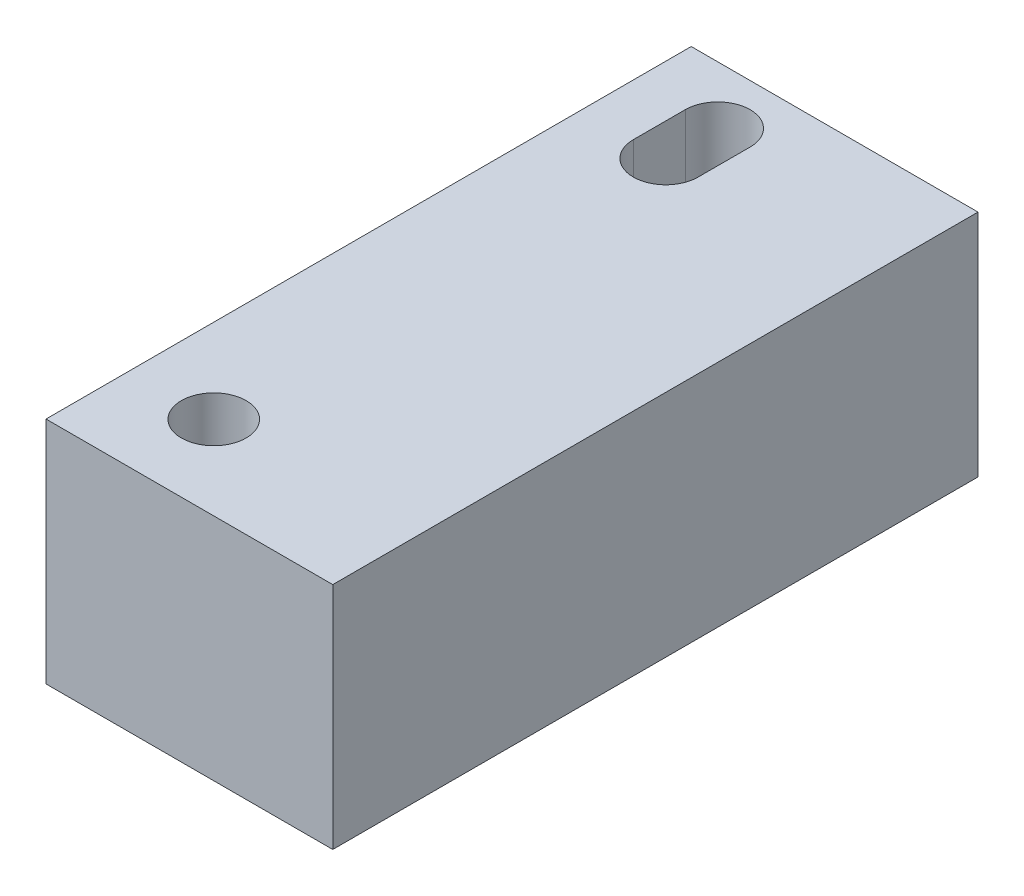
ISO-10303-21;
HEADER;
FILE_DESCRIPTION(('STEP AP214'),'2;1');
FILE_NAME('part.step','',(''),(''),'','','');
FILE_SCHEMA(('AUTOMOTIVE_DESIGN { 1 0 10303 214 1 1 1 1 }'));
ENDSEC;
DATA;
#1=APPLICATION_CONTEXT('core data for automotive mechanical design processes');
#2=APPLICATION_PROTOCOL_DEFINITION('international standard','automotive_design',2000,#1);
#3=PRODUCT_CONTEXT('',#1,'mechanical');
#4=PRODUCT('Part','Part','',(#3));
#5=PRODUCT_RELATED_PRODUCT_CATEGORY('part','',(#4));
#6=PRODUCT_DEFINITION_FORMATION('','',#4);
#7=PRODUCT_DEFINITION_CONTEXT('part definition',#1,'design');
#8=PRODUCT_DEFINITION('design','',#6,#7);
#9=PRODUCT_DEFINITION_SHAPE('','',#8);
#10=(LENGTH_UNIT() NAMED_UNIT(*) SI_UNIT(.MILLI.,.METRE.));
#11=(NAMED_UNIT(*) PLANE_ANGLE_UNIT() SI_UNIT($,.RADIAN.));
#12=(NAMED_UNIT(*) SI_UNIT($,.STERADIAN.) SOLID_ANGLE_UNIT());
#13=UNCERTAINTY_MEASURE_WITH_UNIT(LENGTH_MEASURE(1.E-05),#10,'distance_accuracy_value','');
#14=(GEOMETRIC_REPRESENTATION_CONTEXT(3) GLOBAL_UNCERTAINTY_ASSIGNED_CONTEXT((#13)) GLOBAL_UNIT_ASSIGNED_CONTEXT((#10,
#11,#12)) REPRESENTATION_CONTEXT('',''));
#15=CARTESIAN_POINT('',(0.,0.,0.));
#16=DIRECTION('',(0.,0.,1.));
#17=DIRECTION('',(1.,0.,0.));
#18=AXIS2_PLACEMENT_3D('',#15,#16,#17);
#19=CARTESIAN_POINT('',(-25.7385806955994,15.24,-19.8332435881479));
#20=DIRECTION('',(0.,-1.,0.));
#21=DIRECTION('',(0.,0.,-1.));
#22=AXIS2_PLACEMENT_3D('',#19,#20,#21);
#23=PLANE('',#22);
#24=DIRECTION('',(0.,0.,1.));
#25=VECTOR('',#24,1.);
#26=CARTESIAN_POINT('',(-22.3032306955994,15.24,-16.0041935881479));
#27=LINE('',#26,#25);
#28=CARTESIAN_POINT('',(-22.3032306955994,15.24,-16.0041935881479));
#29=VERTEX_POINT('',#28);
#30=CARTESIAN_POINT('',(-22.3032306955994,15.24,-12.5497935881479));
#31=VERTEX_POINT('',#30);
#32=EDGE_CURVE('E116',#29,#31,#27,.T.);
#33=ORIENTED_EDGE('',*,*,#32,.F.);
#34=CARTESIAN_POINT('',(-20.1505806955994,15.24,-16.0041935881479));
#35=DIRECTION('',(0.,1.,0.));
#36=DIRECTION('',(0.,0.,1.));
#37=AXIS2_PLACEMENT_3D('',#34,#35,#36);
#38=CIRCLE('',#37,2.15265);
#39=CARTESIAN_POINT('',(-17.9979306955994,15.24,-16.0041935881479));
#40=VERTEX_POINT('',#39);
#41=EDGE_CURVE('E47',#40,#29,#38,.T.);
#42=ORIENTED_EDGE('',*,*,#41,.F.);
#43=DIRECTION('',(0.,0.,-1.));
#44=VECTOR('',#43,1.);
#45=CARTESIAN_POINT('',(-17.9979306955994,15.24,-16.0041935881479));
#46=LINE('',#45,#44);
#47=CARTESIAN_POINT('',(-17.9979306955994,15.24,-12.5497935881479));
#48=VERTEX_POINT('',#47);
#49=EDGE_CURVE('E109',#48,#40,#46,.T.);
#50=ORIENTED_EDGE('',*,*,#49,.F.);
#51=CARTESIAN_POINT('',(-20.1505806955994,15.24,-12.5497935881479));
#52=DIRECTION('',(0.,1.,0.));
#53=DIRECTION('',(0.,0.,1.));
#54=AXIS2_PLACEMENT_3D('',#51,#52,#53);
#55=CIRCLE('',#54,2.15265);
#56=EDGE_CURVE('E123',#31,#48,#55,.T.);
#57=ORIENTED_EDGE('',*,*,#56,.F.);
#58=EDGE_LOOP('',(#33,#42,#50,#57));
#59=FACE_BOUND('',#58,.T.);
#60=DIRECTION('',(0.,0.,1.));
#61=VECTOR('',#60,1.);
#62=CARTESIAN_POINT('',(-25.7385806955994,15.24,23.0292564118521));
#63=LINE('',#62,#61);
#64=CARTESIAN_POINT('',(-25.7385806955994,15.24,-19.8332435881479));
#65=VERTEX_POINT('',#64);
#66=CARTESIAN_POINT('',(-25.7385806955994,15.24,23.0292564118521));
#67=VERTEX_POINT('',#66);
#68=EDGE_CURVE('E138',#65,#67,#63,.T.);
#69=ORIENTED_EDGE('',*,*,#68,.T.);
#70=DIRECTION('',(1.,0.,0.));
#71=VECTOR('',#70,1.);
#72=CARTESIAN_POINT('',(-25.7385806955994,15.24,23.0292564118521));
#73=LINE('',#72,#71);
#74=CARTESIAN_POINT('',(-6.68858069559937,15.24,23.0292564118521));
#75=VERTEX_POINT('',#74);
#76=EDGE_CURVE('E141',#67,#75,#73,.T.);
#77=ORIENTED_EDGE('',*,*,#76,.T.);
#78=DIRECTION('',(0.,0.,-1.));
#79=VECTOR('',#78,1.);
#80=CARTESIAN_POINT('',(-6.68858069559937,15.24,23.0292564118521));
#81=LINE('',#80,#79);
#82=CARTESIAN_POINT('',(-6.68858069559937,15.24,-19.8332435881479));
#83=VERTEX_POINT('',#82);
#84=EDGE_CURVE('E144',#75,#83,#81,.T.);
#85=ORIENTED_EDGE('',*,*,#84,.T.);
#86=DIRECTION('',(-1.,0.,0.));
#87=VECTOR('',#86,1.);
#88=CARTESIAN_POINT('',(-25.7385806955994,15.24,-19.8332435881479));
#89=LINE('',#88,#87);
#90=EDGE_CURVE('E146',#83,#65,#89,.T.);
#91=ORIENTED_EDGE('',*,*,#90,.T.);
#92=EDGE_LOOP('',(#69,#77,#85,#91));
#93=FACE_BOUND('',#92,.T.);
#94=CARTESIAN_POINT('',(-20.1505806955994,15.24,17.4730064118521));
#95=DIRECTION('',(0.,1.,0.));
#96=DIRECTION('',(0.,0.,1.));
#97=AXIS2_PLACEMENT_3D('',#94,#95,#96);
#98=CIRCLE('',#97,2.15265);
#99=CARTESIAN_POINT('',(-20.1505806955994,15.24,19.6256564118521));
#100=VERTEX_POINT('',#99);
#101=EDGE_CURVE('E103',#100,#100,#98,.T.);
#102=ORIENTED_EDGE('',*,*,#101,.F.);
#103=EDGE_LOOP('',(#102));
#104=FACE_BOUND('',#103,.T.);
#105=ADVANCED_FACE('F32',(#59,#93,#104),#23,.F.);
#106=CARTESIAN_POINT('',(-25.7385806955994,15.24,23.0292564118521));
#107=DIRECTION('',(1.,0.,0.));
#108=DIRECTION('',(0.,0.,-1.));
#109=AXIS2_PLACEMENT_3D('',#106,#107,#108);
#110=PLANE('',#109);
#111=DIRECTION('',(0.,0.,1.));
#112=VECTOR('',#111,1.);
#113=CARTESIAN_POINT('',(-25.7385806955994,0.,23.0292564118521));
#114=LINE('',#113,#112);
#115=CARTESIAN_POINT('',(-25.7385806955994,0.,-19.8332435881479));
#116=VERTEX_POINT('',#115);
#117=CARTESIAN_POINT('',(-25.7385806955994,0.,23.0292564118521));
#118=VERTEX_POINT('',#117);
#119=EDGE_CURVE('E137',#116,#118,#114,.T.);
#120=ORIENTED_EDGE('',*,*,#119,.T.);
#121=DIRECTION('',(0.,-1.,0.));
#122=VECTOR('',#121,1.);
#123=CARTESIAN_POINT('',(-25.7385806955994,15.24,23.0292564118521));
#124=LINE('',#123,#122);
#125=EDGE_CURVE('E11',#67,#118,#124,.T.);
#126=ORIENTED_EDGE('',*,*,#125,.F.);
#127=ORIENTED_EDGE('',*,*,#68,.F.);
#128=DIRECTION('',(0.,-1.,0.));
#129=VECTOR('',#128,1.);
#130=CARTESIAN_POINT('',(-25.7385806955994,15.24,-19.8332435881479));
#131=LINE('',#130,#129);
#132=EDGE_CURVE('E148',#65,#116,#131,.T.);
#133=ORIENTED_EDGE('',*,*,#132,.T.);
#134=EDGE_LOOP('',(#120,#126,#127,#133));
#135=FACE_BOUND('',#134,.T.);
#136=ADVANCED_FACE('F34',(#135),#110,.F.);
#137=CARTESIAN_POINT('',(-25.7385806955994,15.24,23.0292564118521));
#138=DIRECTION('',(0.,0.,-1.));
#139=DIRECTION('',(-1.,0.,0.));
#140=AXIS2_PLACEMENT_3D('',#137,#138,#139);
#141=PLANE('',#140);
#142=DIRECTION('',(1.,0.,0.));
#143=VECTOR('',#142,1.);
#144=CARTESIAN_POINT('',(-25.7385806955994,0.,23.0292564118521));
#145=LINE('',#144,#143);
#146=CARTESIAN_POINT('',(-6.68858069559937,0.,23.0292564118521));
#147=VERTEX_POINT('',#146);
#148=EDGE_CURVE('E151',#118,#147,#145,.T.);
#149=ORIENTED_EDGE('',*,*,#148,.T.);
#150=DIRECTION('',(0.,-1.,0.));
#151=VECTOR('',#150,1.);
#152=CARTESIAN_POINT('',(-6.68858069559937,15.24,23.0292564118521));
#153=LINE('',#152,#151);
#154=EDGE_CURVE('E40',#75,#147,#153,.T.);
#155=ORIENTED_EDGE('',*,*,#154,.F.);
#156=ORIENTED_EDGE('',*,*,#76,.F.);
#157=ORIENTED_EDGE('',*,*,#125,.T.);
#158=EDGE_LOOP('',(#149,#155,#156,#157));
#159=FACE_BOUND('',#158,.T.);
#160=ADVANCED_FACE('F180',(#159),#141,.F.);
#161=CARTESIAN_POINT('',(-6.68858069559937,15.24,23.0292564118521));
#162=DIRECTION('',(-1.,0.,0.));
#163=DIRECTION('',(0.,0.,1.));
#164=AXIS2_PLACEMENT_3D('',#161,#162,#163);
#165=PLANE('',#164);
#166=DIRECTION('',(0.,0.,-1.));
#167=VECTOR('',#166,1.);
#168=CARTESIAN_POINT('',(-6.68858069559937,0.,23.0292564118521));
#169=LINE('',#168,#167);
#170=CARTESIAN_POINT('',(-6.68858069559937,0.,-19.8332435881479));
#171=VERTEX_POINT('',#170);
#172=EDGE_CURVE('E153',#147,#171,#169,.T.);
#173=ORIENTED_EDGE('',*,*,#172,.T.);
#174=DIRECTION('',(0.,-1.,0.));
#175=VECTOR('',#174,1.);
#176=CARTESIAN_POINT('',(-6.68858069559937,15.24,-19.8332435881479));
#177=LINE('',#176,#175);
#178=EDGE_CURVE('E158',#83,#171,#177,.T.);
#179=ORIENTED_EDGE('',*,*,#178,.F.);
#180=ORIENTED_EDGE('',*,*,#84,.F.);
#181=ORIENTED_EDGE('',*,*,#154,.T.);
#182=EDGE_LOOP('',(#173,#179,#180,#181));
#183=FACE_BOUND('',#182,.T.);
#184=ADVANCED_FACE('F165',(#183),#165,.F.);
#185=CARTESIAN_POINT('',(-25.7385806955994,15.24,-19.8332435881479));
#186=DIRECTION('',(0.,0.,1.));
#187=DIRECTION('',(1.,0.,0.));
#188=AXIS2_PLACEMENT_3D('',#185,#186,#187);
#189=PLANE('',#188);
#190=DIRECTION('',(-1.,0.,0.));
#191=VECTOR('',#190,1.);
#192=CARTESIAN_POINT('',(-25.7385806955994,0.,-19.8332435881479));
#193=LINE('',#192,#191);
#194=EDGE_CURVE('E142',#171,#116,#193,.T.);
#195=ORIENTED_EDGE('',*,*,#194,.T.);
#196=ORIENTED_EDGE('',*,*,#132,.F.);
#197=ORIENTED_EDGE('',*,*,#90,.F.);
#198=ORIENTED_EDGE('',*,*,#178,.T.);
#199=EDGE_LOOP('',(#195,#196,#197,#198));
#200=FACE_BOUND('',#199,.T.);
#201=ADVANCED_FACE('F173',(#200),#189,.F.);
#202=CARTESIAN_POINT('',(-25.7385806955994,0.,-19.8332435881479));
#203=DIRECTION('',(0.,-1.,0.));
#204=DIRECTION('',(0.,0.,-1.));
#205=AXIS2_PLACEMENT_3D('',#202,#203,#204);
#206=PLANE('',#205);
#207=CARTESIAN_POINT('',(-20.1505806955994,0.,-16.0041935881479));
#208=DIRECTION('',(0.,-1.,0.));
#209=DIRECTION('',(0.,0.,-1.));
#210=AXIS2_PLACEMENT_3D('',#207,#208,#209);
#211=CIRCLE('',#210,2.15265);
#212=CARTESIAN_POINT('',(-17.9979306955994,0.,-16.0041935881479));
#213=VERTEX_POINT('',#212);
#214=CARTESIAN_POINT('',(-22.3032306955994,0.,-16.0041935881479));
#215=VERTEX_POINT('',#214);
#216=EDGE_CURVE('E107',#213,#215,#211,.F.);
#217=ORIENTED_EDGE('',*,*,#216,.T.);
#218=DIRECTION('',(0.,0.,1.));
#219=VECTOR('',#218,1.);
#220=CARTESIAN_POINT('',(-22.3032306955994,0.,-16.0041935881479));
#221=LINE('',#220,#219);
#222=CARTESIAN_POINT('',(-22.3032306955994,0.,-12.5497935881479));
#223=VERTEX_POINT('',#222);
#224=EDGE_CURVE('E96',#215,#223,#221,.T.);
#225=ORIENTED_EDGE('',*,*,#224,.T.);
#226=CARTESIAN_POINT('',(-20.1505806955994,0.,-12.5497935881479));
#227=DIRECTION('',(0.,-1.,0.));
#228=DIRECTION('',(0.,0.,-1.));
#229=AXIS2_PLACEMENT_3D('',#226,#227,#228);
#230=CIRCLE('',#229,2.15265);
#231=CARTESIAN_POINT('',(-17.9979306955994,0.,-12.5497935881479));
#232=VERTEX_POINT('',#231);
#233=EDGE_CURVE('E118',#223,#232,#230,.F.);
#234=ORIENTED_EDGE('',*,*,#233,.T.);
#235=DIRECTION('',(0.,0.,-1.));
#236=VECTOR('',#235,1.);
#237=CARTESIAN_POINT('',(-17.9979306955994,0.,-16.0041935881479));
#238=LINE('',#237,#236);
#239=EDGE_CURVE('E114',#232,#213,#238,.T.);
#240=ORIENTED_EDGE('',*,*,#239,.T.);
#241=EDGE_LOOP('',(#217,#225,#234,#240));
#242=FACE_BOUND('',#241,.T.);
#243=CARTESIAN_POINT('',(-20.1505806955994,0.,17.4730064118521));
#244=DIRECTION('',(0.,-1.,0.));
#245=DIRECTION('',(0.,0.,-1.));
#246=AXIS2_PLACEMENT_3D('',#243,#244,#245);
#247=CIRCLE('',#246,2.15265);
#248=CARTESIAN_POINT('',(-20.1505806955994,0.,15.3203564118521));
#249=VERTEX_POINT('',#248);
#250=EDGE_CURVE('E134',#249,#249,#247,.T.);
#251=ORIENTED_EDGE('',*,*,#250,.F.);
#252=EDGE_LOOP('',(#251));
#253=FACE_BOUND('',#252,.T.);
#254=ORIENTED_EDGE('',*,*,#119,.F.);
#255=ORIENTED_EDGE('',*,*,#194,.F.);
#256=ORIENTED_EDGE('',*,*,#172,.F.);
#257=ORIENTED_EDGE('',*,*,#148,.F.);
#258=EDGE_LOOP('',(#254,#255,#256,#257));
#259=FACE_BOUND('',#258,.T.);
#260=ADVANCED_FACE('F112',(#242,#253,#259),#206,.T.);
#261=CARTESIAN_POINT('',(-20.1505806955994,15.24,17.4730064118521));
#262=DIRECTION('',(0.,1.,0.));
#263=DIRECTION('',(0.,0.,1.));
#264=AXIS2_PLACEMENT_3D('',#261,#262,#263);
#265=CYLINDRICAL_SURFACE('',#264,2.15265);
#266=ORIENTED_EDGE('',*,*,#101,.T.);
#267=EDGE_LOOP('',(#266));
#268=FACE_BOUND('',#267,.T.);
#269=ORIENTED_EDGE('',*,*,#250,.T.);
#270=EDGE_LOOP('',(#269));
#271=FACE_BOUND('',#270,.T.);
#272=ADVANCED_FACE('F194',(#268,#271),#265,.F.);
#273=CARTESIAN_POINT('',(-20.1505806955994,-0.000999999999999265,-16.0041935881479));
#274=DIRECTION('',(0.,1.,0.));
#275=DIRECTION('',(0.,0.,1.));
#276=AXIS2_PLACEMENT_3D('',#273,#274,#275);
#277=CYLINDRICAL_SURFACE('',#276,2.15265);
#278=DIRECTION('',(0.,1.,0.));
#279=VECTOR('',#278,1.);
#280=CARTESIAN_POINT('',(-17.9979306955994,-0.000999999999999265,-16.0041935881479));
#281=LINE('',#280,#279);
#282=EDGE_CURVE('E104',#213,#40,#281,.T.);
#283=ORIENTED_EDGE('',*,*,#282,.T.);
#284=ORIENTED_EDGE('',*,*,#41,.T.);
#285=DIRECTION('',(0.,1.,0.));
#286=VECTOR('',#285,1.);
#287=CARTESIAN_POINT('',(-22.3032306955994,-0.000999999999999265,-16.0041935881479));
#288=LINE('',#287,#286);
#289=EDGE_CURVE('E98',#215,#29,#288,.T.);
#290=ORIENTED_EDGE('',*,*,#289,.F.);
#291=ORIENTED_EDGE('',*,*,#216,.F.);
#292=EDGE_LOOP('',(#283,#284,#290,#291));
#293=FACE_BOUND('',#292,.T.);
#294=ADVANCED_FACE('F106',(#293),#277,.F.);
#295=CARTESIAN_POINT('',(-17.9979306955994,-0.000999999999999265,-16.0041935881479));
#296=DIRECTION('',(1.,0.,0.));
#297=DIRECTION('',(0.,0.,-1.));
#298=AXIS2_PLACEMENT_3D('',#295,#296,#297);
#299=PLANE('',#298);
#300=DIRECTION('',(0.,1.,0.));
#301=VECTOR('',#300,1.);
#302=CARTESIAN_POINT('',(-17.9979306955994,-0.000999999999999265,-12.5497935881479));
#303=LINE('',#302,#301);
#304=EDGE_CURVE('E129',#232,#48,#303,.T.);
#305=ORIENTED_EDGE('',*,*,#304,.T.);
#306=ORIENTED_EDGE('',*,*,#49,.T.);
#307=ORIENTED_EDGE('',*,*,#282,.F.);
#308=ORIENTED_EDGE('',*,*,#239,.F.);
#309=EDGE_LOOP('',(#305,#306,#307,#308));
#310=FACE_BOUND('',#309,.T.);
#311=ADVANCED_FACE('F219',(#310),#299,.F.);
#312=CARTESIAN_POINT('',(-20.1505806955994,-0.000999999999999265,-12.5497935881479));
#313=DIRECTION('',(0.,1.,0.));
#314=DIRECTION('',(0.,0.,1.));
#315=AXIS2_PLACEMENT_3D('',#312,#313,#314);
#316=CYLINDRICAL_SURFACE('',#315,2.15265);
#317=DIRECTION('',(0.,1.,0.));
#318=VECTOR('',#317,1.);
#319=CARTESIAN_POINT('',(-22.3032306955994,-0.000999999999999265,-12.5497935881479));
#320=LINE('',#319,#318);
#321=EDGE_CURVE('E55',#223,#31,#320,.T.);
#322=ORIENTED_EDGE('',*,*,#321,.T.);
#323=ORIENTED_EDGE('',*,*,#56,.T.);
#324=ORIENTED_EDGE('',*,*,#304,.F.);
#325=ORIENTED_EDGE('',*,*,#233,.F.);
#326=EDGE_LOOP('',(#322,#323,#324,#325));
#327=FACE_BOUND('',#326,.T.);
#328=ADVANCED_FACE('F225',(#327),#316,.F.);
#329=CARTESIAN_POINT('',(-22.3032306955994,-0.000999999999999265,-16.0041935881479));
#330=DIRECTION('',(-1.,0.,0.));
#331=DIRECTION('',(0.,0.,1.));
#332=AXIS2_PLACEMENT_3D('',#329,#330,#331);
#333=PLANE('',#332);
#334=ORIENTED_EDGE('',*,*,#289,.T.);
#335=ORIENTED_EDGE('',*,*,#32,.T.);
#336=ORIENTED_EDGE('',*,*,#321,.F.);
#337=ORIENTED_EDGE('',*,*,#224,.F.);
#338=EDGE_LOOP('',(#334,#335,#336,#337));
#339=FACE_BOUND('',#338,.T.);
#340=ADVANCED_FACE('F97',(#339),#333,.F.);
#341=CLOSED_SHELL('',(#105,#136,#160,#184,#201,#260,#272,#294,#311,#328,#340));
#342=MANIFOLD_SOLID_BREP('B2',#341);
#343=ADVANCED_BREP_SHAPE_REPRESENTATION('',(#18,#342),#14);
#344=SHAPE_DEFINITION_REPRESENTATION(#9,#343);
ENDSEC;
END-ISO-10303-21;
